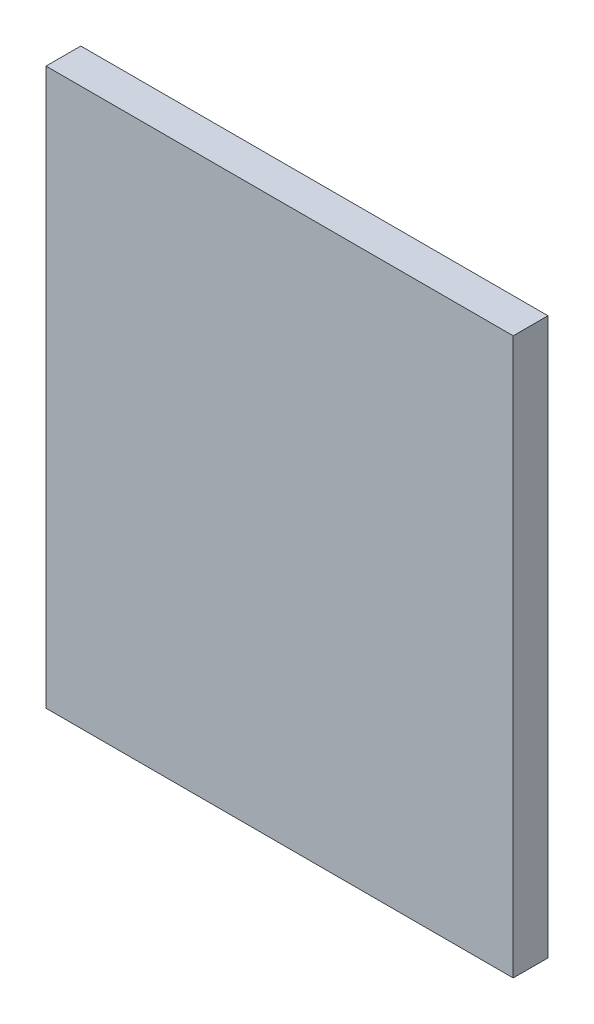
ISO-10303-21;
HEADER;
FILE_DESCRIPTION(('STEP AP214'),'2;1');
FILE_NAME('part.step','',(''),(''),'','','');
FILE_SCHEMA(('AUTOMOTIVE_DESIGN { 1 0 10303 214 1 1 1 1 }'));
ENDSEC;
DATA;
#1=APPLICATION_CONTEXT('core data for automotive mechanical design processes');
#2=APPLICATION_PROTOCOL_DEFINITION('international standard','automotive_design',2000,#1);
#3=PRODUCT_CONTEXT('',#1,'mechanical');
#4=PRODUCT('Part','Part','',(#3));
#5=PRODUCT_RELATED_PRODUCT_CATEGORY('part','',(#4));
#6=PRODUCT_DEFINITION_FORMATION('','',#4);
#7=PRODUCT_DEFINITION_CONTEXT('part definition',#1,'design');
#8=PRODUCT_DEFINITION('design','',#6,#7);
#9=PRODUCT_DEFINITION_SHAPE('','',#8);
#10=(LENGTH_UNIT() NAMED_UNIT(*) SI_UNIT(.MILLI.,.METRE.));
#11=(NAMED_UNIT(*) PLANE_ANGLE_UNIT() SI_UNIT($,.RADIAN.));
#12=(NAMED_UNIT(*) SI_UNIT($,.STERADIAN.) SOLID_ANGLE_UNIT());
#13=UNCERTAINTY_MEASURE_WITH_UNIT(LENGTH_MEASURE(1.E-05),#10,'distance_accuracy_value','');
#14=(GEOMETRIC_REPRESENTATION_CONTEXT(3) GLOBAL_UNCERTAINTY_ASSIGNED_CONTEXT((#13)) GLOBAL_UNIT_ASSIGNED_CONTEXT((#10,
#11,#12)) REPRESENTATION_CONTEXT('',''));
#15=CARTESIAN_POINT('',(0.,0.,0.));
#16=DIRECTION('',(0.,0.,1.));
#17=DIRECTION('',(1.,0.,0.));
#18=AXIS2_PLACEMENT_3D('',#15,#16,#17);
#19=CARTESIAN_POINT('',(21.336,-25.4,1.5875));
#20=DIRECTION('',(-1.,0.,0.));
#21=DIRECTION('',(0.,0.,1.));
#22=AXIS2_PLACEMENT_3D('',#19,#20,#21);
#23=PLANE('',#22);
#24=DIRECTION('',(0.,1.,0.));
#25=VECTOR('',#24,1.);
#26=CARTESIAN_POINT('',(21.336,-25.4,-1.5875));
#27=LINE('',#26,#25);
#28=CARTESIAN_POINT('',(21.336,-25.4,-1.5875));
#29=VERTEX_POINT('',#28);
#30=CARTESIAN_POINT('',(21.336,25.4,-1.5875));
#31=VERTEX_POINT('',#30);
#32=EDGE_CURVE('E107',#29,#31,#27,.T.);
#33=ORIENTED_EDGE('',*,*,#32,.T.);
#34=DIRECTION('',(0.,0.,-1.));
#35=VECTOR('',#34,1.);
#36=CARTESIAN_POINT('',(21.336,25.4,1.5875));
#37=LINE('',#36,#35);
#38=CARTESIAN_POINT('',(21.336,25.4,1.5875));
#39=VERTEX_POINT('',#38);
#40=EDGE_CURVE('E11',#39,#31,#37,.T.);
#41=ORIENTED_EDGE('',*,*,#40,.F.);
#42=DIRECTION('',(0.,1.,0.));
#43=VECTOR('',#42,1.);
#44=CARTESIAN_POINT('',(21.336,-25.4,1.5875));
#45=LINE('',#44,#43);
#46=CARTESIAN_POINT('',(21.336,-25.4,1.5875));
#47=VERTEX_POINT('',#46);
#48=EDGE_CURVE('E91',#47,#39,#45,.T.);
#49=ORIENTED_EDGE('',*,*,#48,.F.);
#50=DIRECTION('',(0.,0.,-1.));
#51=VECTOR('',#50,1.);
#52=CARTESIAN_POINT('',(21.336,-25.4,1.5875));
#53=LINE('',#52,#51);
#54=EDGE_CURVE('E103',#47,#29,#53,.T.);
#55=ORIENTED_EDGE('',*,*,#54,.T.);
#56=EDGE_LOOP('',(#33,#41,#49,#55));
#57=FACE_BOUND('',#56,.T.);
#58=ADVANCED_FACE('F39',(#57),#23,.F.);
#59=CARTESIAN_POINT('',(-21.336,25.4,1.5875));
#60=DIRECTION('',(0.,-1.,0.));
#61=DIRECTION('',(0.,0.,-1.));
#62=AXIS2_PLACEMENT_3D('',#59,#60,#61);
#63=PLANE('',#62);
#64=DIRECTION('',(-1.,0.,0.));
#65=VECTOR('',#64,1.);
#66=CARTESIAN_POINT('',(-21.336,25.4,-1.5875));
#67=LINE('',#66,#65);
#68=CARTESIAN_POINT('',(-21.336,25.4,-1.5875));
#69=VERTEX_POINT('',#68);
#70=EDGE_CURVE('E96',#31,#69,#67,.T.);
#71=ORIENTED_EDGE('',*,*,#70,.T.);
#72=DIRECTION('',(0.,0.,-1.));
#73=VECTOR('',#72,1.);
#74=CARTESIAN_POINT('',(-21.336,25.4,1.5875));
#75=LINE('',#74,#73);
#76=CARTESIAN_POINT('',(-21.336,25.4,1.5875));
#77=VERTEX_POINT('',#76);
#78=EDGE_CURVE('E48',#77,#69,#75,.T.);
#79=ORIENTED_EDGE('',*,*,#78,.F.);
#80=DIRECTION('',(-1.,0.,0.));
#81=VECTOR('',#80,1.);
#82=CARTESIAN_POINT('',(-21.336,25.4,1.5875));
#83=LINE('',#82,#81);
#84=EDGE_CURVE('E86',#39,#77,#83,.T.);
#85=ORIENTED_EDGE('',*,*,#84,.F.);
#86=ORIENTED_EDGE('',*,*,#40,.T.);
#87=EDGE_LOOP('',(#71,#79,#85,#86));
#88=FACE_BOUND('',#87,.T.);
#89=ADVANCED_FACE('F95',(#88),#63,.F.);
#90=CARTESIAN_POINT('',(-21.336,-25.4,1.5875));
#91=DIRECTION('',(1.,0.,0.));
#92=DIRECTION('',(0.,0.,-1.));
#93=AXIS2_PLACEMENT_3D('',#90,#91,#92);
#94=PLANE('',#93);
#95=DIRECTION('',(0.,-1.,0.));
#96=VECTOR('',#95,1.);
#97=CARTESIAN_POINT('',(-21.336,-25.4,-1.5875));
#98=LINE('',#97,#96);
#99=CARTESIAN_POINT('',(-21.336,-25.4,-1.5875));
#100=VERTEX_POINT('',#99);
#101=EDGE_CURVE('E73',#69,#100,#98,.T.);
#102=ORIENTED_EDGE('',*,*,#101,.T.);
#103=DIRECTION('',(0.,0.,-1.));
#104=VECTOR('',#103,1.);
#105=CARTESIAN_POINT('',(-21.336,-25.4,1.5875));
#106=LINE('',#105,#104);
#107=CARTESIAN_POINT('',(-21.336,-25.4,1.5875));
#108=VERTEX_POINT('',#107);
#109=EDGE_CURVE('E98',#108,#100,#106,.T.);
#110=ORIENTED_EDGE('',*,*,#109,.F.);
#111=DIRECTION('',(0.,-1.,0.));
#112=VECTOR('',#111,1.);
#113=CARTESIAN_POINT('',(-21.336,-25.4,1.5875));
#114=LINE('',#113,#112);
#115=EDGE_CURVE('E89',#77,#108,#114,.T.);
#116=ORIENTED_EDGE('',*,*,#115,.F.);
#117=ORIENTED_EDGE('',*,*,#78,.T.);
#118=EDGE_LOOP('',(#102,#110,#116,#117));
#119=FACE_BOUND('',#118,.T.);
#120=ADVANCED_FACE('F99',(#119),#94,.F.);
#121=CARTESIAN_POINT('',(-21.336,-25.4,1.5875));
#122=DIRECTION('',(0.,1.,0.));
#123=DIRECTION('',(0.,0.,1.));
#124=AXIS2_PLACEMENT_3D('',#121,#122,#123);
#125=PLANE('',#124);
#126=DIRECTION('',(1.,0.,0.));
#127=VECTOR('',#126,1.);
#128=CARTESIAN_POINT('',(-21.336,-25.4,-1.5875));
#129=LINE('',#128,#127);
#130=EDGE_CURVE('E79',#100,#29,#129,.T.);
#131=ORIENTED_EDGE('',*,*,#130,.T.);
#132=ORIENTED_EDGE('',*,*,#54,.F.);
#133=DIRECTION('',(1.,0.,0.));
#134=VECTOR('',#133,1.);
#135=CARTESIAN_POINT('',(-21.336,-25.4,1.5875));
#136=LINE('',#135,#134);
#137=EDGE_CURVE('E56',#108,#47,#136,.T.);
#138=ORIENTED_EDGE('',*,*,#137,.F.);
#139=ORIENTED_EDGE('',*,*,#109,.T.);
#140=EDGE_LOOP('',(#131,#132,#138,#139));
#141=FACE_BOUND('',#140,.T.);
#142=ADVANCED_FACE('F120',(#141),#125,.F.);
#143=CARTESIAN_POINT('',(0.,0.,1.5875));
#144=DIRECTION('',(0.,0.,-1.));
#145=DIRECTION('',(-1.,0.,0.));
#146=AXIS2_PLACEMENT_3D('',#143,#144,#145);
#147=PLANE('',#146);
#148=ORIENTED_EDGE('',*,*,#48,.T.);
#149=ORIENTED_EDGE('',*,*,#84,.T.);
#150=ORIENTED_EDGE('',*,*,#115,.T.);
#151=ORIENTED_EDGE('',*,*,#137,.T.);
#152=EDGE_LOOP('',(#148,#149,#150,#151));
#153=FACE_BOUND('',#152,.T.);
#154=ADVANCED_FACE('F87',(#153),#147,.F.);
#155=CARTESIAN_POINT('',(0.,0.,-1.5875));
#156=DIRECTION('',(0.,0.,-1.));
#157=DIRECTION('',(-1.,0.,0.));
#158=AXIS2_PLACEMENT_3D('',#155,#156,#157);
#159=PLANE('',#158);
#160=ORIENTED_EDGE('',*,*,#32,.F.);
#161=ORIENTED_EDGE('',*,*,#130,.F.);
#162=ORIENTED_EDGE('',*,*,#101,.F.);
#163=ORIENTED_EDGE('',*,*,#70,.F.);
#164=EDGE_LOOP('',(#160,#161,#162,#163));
#165=FACE_BOUND('',#164,.T.);
#166=ADVANCED_FACE('F123',(#165),#159,.T.);
#167=CLOSED_SHELL('',(#58,#89,#120,#142,#154,#166));
#168=MANIFOLD_SOLID_BREP('B2',#167);
#169=ADVANCED_BREP_SHAPE_REPRESENTATION('',(#18,#168),#14);
#170=SHAPE_DEFINITION_REPRESENTATION(#9,#169);
ENDSEC;
END-ISO-10303-21;
